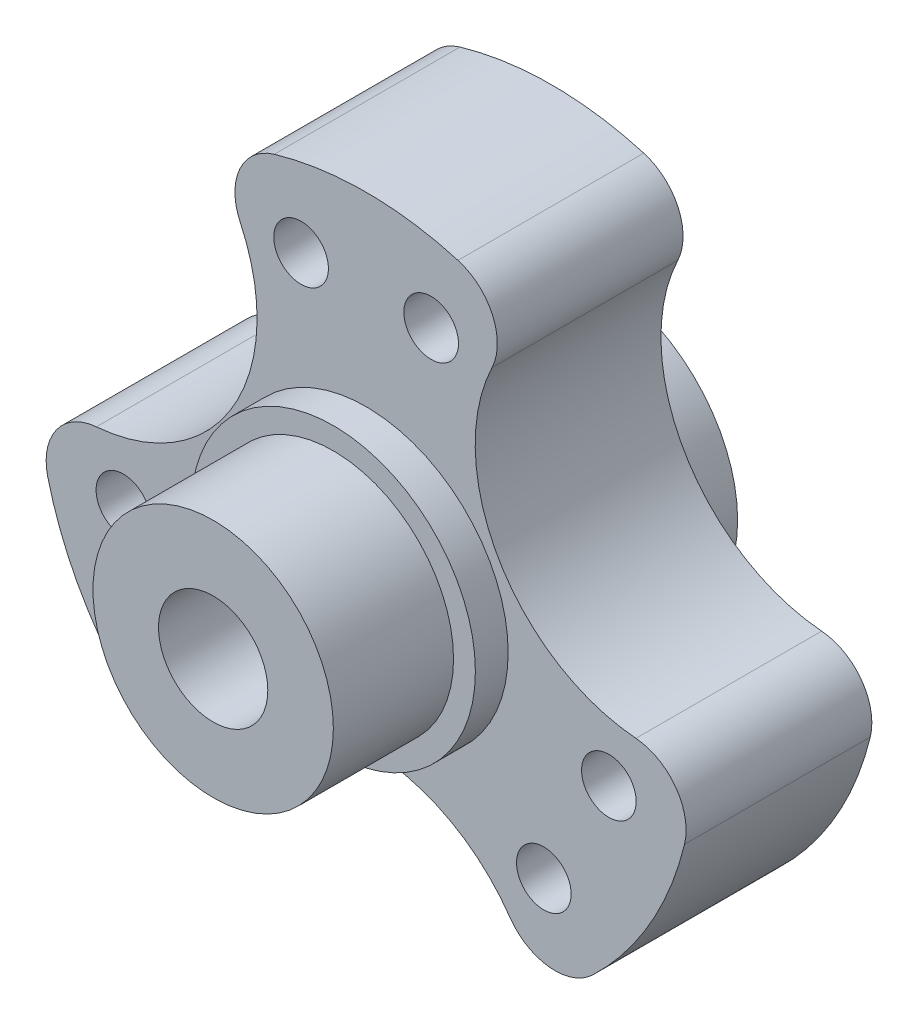
ISO-10303-21;
HEADER;
FILE_DESCRIPTION(('STEP AP214'),'2;1');
FILE_NAME('part.step','',(''),(''),'','','');
FILE_SCHEMA(('AUTOMOTIVE_DESIGN { 1 0 10303 214 1 1 1 1 }'));
ENDSEC;
DATA;
#1=APPLICATION_CONTEXT('core data for automotive mechanical design processes');
#2=APPLICATION_PROTOCOL_DEFINITION('international standard','automotive_design',2000,#1);
#3=PRODUCT_CONTEXT('',#1,'mechanical');
#4=PRODUCT('Part','Part','',(#3));
#5=PRODUCT_RELATED_PRODUCT_CATEGORY('part','',(#4));
#6=PRODUCT_DEFINITION_FORMATION('','',#4);
#7=PRODUCT_DEFINITION_CONTEXT('part definition',#1,'design');
#8=PRODUCT_DEFINITION('design','',#6,#7);
#9=PRODUCT_DEFINITION_SHAPE('','',#8);
#10=(LENGTH_UNIT() NAMED_UNIT(*) SI_UNIT(.MILLI.,.METRE.));
#11=(NAMED_UNIT(*) PLANE_ANGLE_UNIT() SI_UNIT($,.RADIAN.));
#12=(NAMED_UNIT(*) SI_UNIT($,.STERADIAN.) SOLID_ANGLE_UNIT());
#13=UNCERTAINTY_MEASURE_WITH_UNIT(LENGTH_MEASURE(1.E-05),#10,'distance_accuracy_value','');
#14=(GEOMETRIC_REPRESENTATION_CONTEXT(3) GLOBAL_UNCERTAINTY_ASSIGNED_CONTEXT((#13)) GLOBAL_UNIT_ASSIGNED_CONTEXT((#10,
#11,#12)) REPRESENTATION_CONTEXT('',''));
#15=CARTESIAN_POINT('',(0.,0.,0.));
#16=DIRECTION('',(0.,0.,1.));
#17=DIRECTION('',(1.,0.,0.));
#18=AXIS2_PLACEMENT_3D('',#15,#16,#17);
#19=CARTESIAN_POINT('',(0.,0.,17.));
#20=DIRECTION('',(0.,0.,1.));
#21=DIRECTION('',(1.,0.,0.));
#22=AXIS2_PLACEMENT_3D('',#19,#20,#21);
#23=PLANE('',#22);
#24=CARTESIAN_POINT('',(-25.9807621135332,14.9999999999999,17.));
#25=DIRECTION('',(0.,0.,1.));
#26=DIRECTION('',(-0.500000000000004,0.866025403784436,0.));
#27=AXIS2_PLACEMENT_3D('',#24,#25,#26);
#28=CIRCLE('',#27,16.);
#29=CARTESIAN_POINT('',(-24.6896299452622,-0.947820469395108,17.));
#30=VERTEX_POINT('',#29);
#31=CARTESIAN_POINT('',(-11.5239783679081,21.8557569773315,17.));
#32=VERTEX_POINT('',#31);
#33=EDGE_CURVE('E214',#30,#32,#28,.T.);
#34=ORIENTED_EDGE('',*,*,#33,.F.);
#35=CARTESIAN_POINT('',(-24.2861511426775,-5.93151436608106,17.));
#36=DIRECTION('',(0.,0.,1.));
#37=DIRECTION('',(1.,0.,0.));
#38=AXIS2_PLACEMENT_3D('',#35,#36,#37);
#39=CIRCLE('',#38,5.);
#40=CARTESIAN_POINT('',(-29.143381371213,-7.11781723929727,17.));
#41=VERTEX_POINT('',#40);
#42=EDGE_CURVE('E187',#30,#41,#39,.T.);
#43=ORIENTED_EDGE('',*,*,#42,.T.);
#44=CARTESIAN_POINT('',(0.,0.,17.));
#45=DIRECTION('',(0.,0.,1.));
#46=DIRECTION('',(1.,0.,0.));
#47=AXIS2_PLACEMENT_3D('',#44,#45,#46);
#48=CIRCLE('',#47,30.);
#49=CARTESIAN_POINT('',(-20.7359012343325,-21.6800000000001,17.));
#50=VERTEX_POINT('',#49);
#51=EDGE_CURVE('E146',#41,#50,#48,.T.);
#52=ORIENTED_EDGE('',*,*,#51,.T.);
#53=CARTESIAN_POINT('',(-17.2799176952771,-18.0666666666668,17.));
#54=DIRECTION('',(0.,0.,1.));
#55=DIRECTION('',(1.,0.,0.));
#56=AXIS2_PLACEMENT_3D('',#53,#54,#55);
#57=CIRCLE('',#56,5.);
#58=CARTESIAN_POINT('',(-13.1656515773539,-20.9079365079366,17.));
#59=VERTEX_POINT('',#58);
#60=EDGE_CURVE('E179',#50,#59,#57,.T.);
#61=ORIENTED_EDGE('',*,*,#60,.T.);
#62=CARTESIAN_POINT('',(2.09901540593194E-13,-30.,17.));
#63=DIRECTION('',(0.,0.,1.));
#64=DIRECTION('',(-0.499999999999992,-0.866025403784443,0.));
#65=AXIS2_PLACEMENT_3D('',#62,#63,#64);
#66=CIRCLE('',#65,16.);
#67=CARTESIAN_POINT('',(13.1656515773542,-20.9079365079364,17.));
#68=VERTEX_POINT('',#67);
#69=EDGE_CURVE('E211',#68,#59,#66,.T.);
#70=ORIENTED_EDGE('',*,*,#69,.F.);
#71=CARTESIAN_POINT('',(17.2799176952774,-18.0666666666665,17.));
#72=DIRECTION('',(0.,0.,1.));
#73=DIRECTION('',(1.,0.,0.));
#74=AXIS2_PLACEMENT_3D('',#71,#72,#73);
#75=CIRCLE('',#74,5.);
#76=CARTESIAN_POINT('',(20.7359012343328,-21.6799999999999,17.));
#77=VERTEX_POINT('',#76);
#78=EDGE_CURVE('E181',#68,#77,#75,.T.);
#79=ORIENTED_EDGE('',*,*,#78,.T.);
#80=CARTESIAN_POINT('',(29.143381371213,-7.11781723929728,17.));
#81=VERTEX_POINT('',#80);
#82=EDGE_CURVE('E158',#77,#81,#48,.T.);
#83=ORIENTED_EDGE('',*,*,#82,.T.);
#84=CARTESIAN_POINT('',(24.2861511426775,-5.93151436608106,17.));
#85=DIRECTION('',(0.,0.,1.));
#86=DIRECTION('',(1.,0.,0.));
#87=AXIS2_PLACEMENT_3D('',#84,#85,#86);
#88=CIRCLE('',#87,5.);
#89=CARTESIAN_POINT('',(24.6896299452622,-0.947820469395113,17.));
#90=VERTEX_POINT('',#89);
#91=EDGE_CURVE('E183',#81,#90,#88,.T.);
#92=ORIENTED_EDGE('',*,*,#91,.T.);
#93=CARTESIAN_POINT('',(25.9807621135332,14.9999999999999,17.));
#94=DIRECTION('',(0.,0.,1.));
#95=DIRECTION('',(1.,0.,0.));
#96=AXIS2_PLACEMENT_3D('',#93,#94,#95);
#97=CIRCLE('',#96,16.);
#98=CARTESIAN_POINT('',(11.5239783679081,21.8557569773315,17.));
#99=VERTEX_POINT('',#98);
#100=EDGE_CURVE('E236',#99,#90,#97,.T.);
#101=ORIENTED_EDGE('',*,*,#100,.F.);
#102=CARTESIAN_POINT('',(7.00623344740029,23.9981810327477,17.));
#103=DIRECTION('',(0.,0.,1.));
#104=DIRECTION('',(1.,0.,0.));
#105=AXIS2_PLACEMENT_3D('',#102,#103,#104);
#106=CIRCLE('',#105,5.);
#107=CARTESIAN_POINT('',(8.40748013688034,28.7978172392972,17.));
#108=VERTEX_POINT('',#107);
#109=EDGE_CURVE('E57',#99,#108,#106,.T.);
#110=ORIENTED_EDGE('',*,*,#109,.T.);
#111=CARTESIAN_POINT('',(-8.40748013688035,28.7978172392972,17.));
#112=VERTEX_POINT('',#111);
#113=EDGE_CURVE('E163',#108,#112,#48,.T.);
#114=ORIENTED_EDGE('',*,*,#113,.T.);
#115=CARTESIAN_POINT('',(-7.00623344740029,23.9981810327477,17.));
#116=DIRECTION('',(0.,0.,1.));
#117=DIRECTION('',(1.,0.,0.));
#118=AXIS2_PLACEMENT_3D('',#115,#116,#117);
#119=CIRCLE('',#118,5.);
#120=EDGE_CURVE('E49',#112,#32,#119,.T.);
#121=ORIENTED_EDGE('',*,*,#120,.T.);
#122=EDGE_LOOP('',(#34,#43,#52,#61,#70,#79,#83,#92,#101,#110,#114,#121));
#123=FACE_BOUND('',#122,.T.);
#124=CARTESIAN_POINT('',(-16.2634559672878,-16.2634559672908,17.));
#125=DIRECTION('',(0.,0.,1.));
#126=DIRECTION('',(1.,0.,0.));
#127=AXIS2_PLACEMENT_3D('',#124,#125,#126);
#128=CIRCLE('',#127,2.5);
#129=CARTESIAN_POINT('',(-13.7634559672878,-16.2634559672908,17.));
#130=VERTEX_POINT('',#129);
#131=EDGE_CURVE('E250',#130,#130,#128,.T.);
#132=ORIENTED_EDGE('',*,*,#131,.F.);
#133=EDGE_LOOP('',(#132));
#134=FACE_BOUND('',#133,.T.);
#135=CARTESIAN_POINT('',(22.2162940046501,-5.95283803735567,17.));
#136=DIRECTION('',(0.,0.,1.));
#137=DIRECTION('',(1.,0.,0.));
#138=AXIS2_PLACEMENT_3D('',#135,#136,#137);
#139=CIRCLE('',#138,2.5);
#140=CARTESIAN_POINT('',(24.7162940046501,-5.95283803735567,17.));
#141=VERTEX_POINT('',#140);
#142=EDGE_CURVE('E262',#141,#141,#139,.T.);
#143=ORIENTED_EDGE('',*,*,#142,.F.);
#144=EDGE_LOOP('',(#143));
#145=FACE_BOUND('',#144,.T.);
#146=CARTESIAN_POINT('',(-5.952838037358,22.2162940046486,17.));
#147=DIRECTION('',(0.,0.,1.));
#148=DIRECTION('',(1.,0.,0.));
#149=AXIS2_PLACEMENT_3D('',#146,#147,#148);
#150=CIRCLE('',#149,2.5);
#151=CARTESIAN_POINT('',(-3.452838037358,22.2162940046486,17.));
#152=VERTEX_POINT('',#151);
#153=EDGE_CURVE('E160',#152,#152,#150,.T.);
#154=ORIENTED_EDGE('',*,*,#153,.F.);
#155=EDGE_LOOP('',(#154));
#156=FACE_BOUND('',#155,.T.);
#157=CARTESIAN_POINT('',(5.95283803735783,22.2162940046486,17.));
#158=DIRECTION('',(0.,0.,1.));
#159=DIRECTION('',(1.,0.,0.));
#160=AXIS2_PLACEMENT_3D('',#157,#158,#159);
#161=CIRCLE('',#160,2.5);
#162=CARTESIAN_POINT('',(8.45283803735783,22.2162940046486,17.));
#163=VERTEX_POINT('',#162);
#164=EDGE_CURVE('E268',#163,#163,#161,.T.);
#165=ORIENTED_EDGE('',*,*,#164,.F.);
#166=EDGE_LOOP('',(#165));
#167=FACE_BOUND('',#166,.T.);
#168=CARTESIAN_POINT('',(16.2634559672922,-16.2634559672882,17.));
#169=DIRECTION('',(0.,0.,1.));
#170=DIRECTION('',(1.,0.,0.));
#171=AXIS2_PLACEMENT_3D('',#168,#169,#170);
#172=CIRCLE('',#171,2.5);
#173=CARTESIAN_POINT('',(18.7634559672922,-16.2634559672882,17.));
#174=VERTEX_POINT('',#173);
#175=EDGE_CURVE('E256',#174,#174,#172,.T.);
#176=ORIENTED_EDGE('',*,*,#175,.F.);
#177=EDGE_LOOP('',(#176));
#178=FACE_BOUND('',#177,.T.);
#179=CARTESIAN_POINT('',(-22.2162940046458,-5.95283803735833,17.));
#180=DIRECTION('',(0.,0.,1.));
#181=DIRECTION('',(1.,0.,0.));
#182=AXIS2_PLACEMENT_3D('',#179,#180,#181);
#183=CIRCLE('',#182,2.5);
#184=CARTESIAN_POINT('',(-19.7162940046458,-5.95283803735833,17.));
#185=VERTEX_POINT('',#184);
#186=EDGE_CURVE('E244',#185,#185,#183,.T.);
#187=ORIENTED_EDGE('',*,*,#186,.F.);
#188=EDGE_LOOP('',(#187));
#189=FACE_BOUND('',#188,.T.);
#190=CARTESIAN_POINT('',(0.,0.,17.));
#191=DIRECTION('',(0.,0.,1.));
#192=DIRECTION('',(1.,0.,0.));
#193=AXIS2_PLACEMENT_3D('',#190,#191,#192);
#194=CIRCLE('',#193,13.);
#195=CARTESIAN_POINT('',(13.,0.,17.));
#196=VERTEX_POINT('',#195);
#197=EDGE_CURVE('E552',#196,#196,#194,.T.);
#198=ORIENTED_EDGE('',*,*,#197,.F.);
#199=EDGE_LOOP('',(#198));
#200=FACE_BOUND('',#199,.T.);
#201=ADVANCED_FACE('F34',(#123,#134,#145,#156,#167,#178,#189,#200),#23,.T.);
#202=CARTESIAN_POINT('',(0.,0.,0.));
#203=DIRECTION('',(0.,0.,1.));
#204=DIRECTION('',(1.,0.,0.));
#205=AXIS2_PLACEMENT_3D('',#202,#203,#204);
#206=PLANE('',#205);
#207=CARTESIAN_POINT('',(-22.2162940046458,-5.95283803735833,0.));
#208=DIRECTION('',(0.,0.,1.));
#209=DIRECTION('',(1.,0.,0.));
#210=AXIS2_PLACEMENT_3D('',#207,#208,#209);
#211=CIRCLE('',#210,2.5);
#212=CARTESIAN_POINT('',(-19.7162940046458,-5.95283803735833,0.));
#213=VERTEX_POINT('',#212);
#214=EDGE_CURVE('E242',#213,#213,#211,.T.);
#215=ORIENTED_EDGE('',*,*,#214,.T.);
#216=EDGE_LOOP('',(#215));
#217=FACE_BOUND('',#216,.T.);
#218=CARTESIAN_POINT('',(-16.2634559672878,-16.2634559672908,0.));
#219=DIRECTION('',(0.,0.,1.));
#220=DIRECTION('',(1.,0.,0.));
#221=AXIS2_PLACEMENT_3D('',#218,#219,#220);
#222=CIRCLE('',#221,2.5);
#223=CARTESIAN_POINT('',(-13.7634559672878,-16.2634559672908,0.));
#224=VERTEX_POINT('',#223);
#225=EDGE_CURVE('E247',#224,#224,#222,.T.);
#226=ORIENTED_EDGE('',*,*,#225,.T.);
#227=EDGE_LOOP('',(#226));
#228=FACE_BOUND('',#227,.T.);
#229=CARTESIAN_POINT('',(16.2634559672922,-16.2634559672882,0.));
#230=DIRECTION('',(0.,0.,1.));
#231=DIRECTION('',(1.,0.,0.));
#232=AXIS2_PLACEMENT_3D('',#229,#230,#231);
#233=CIRCLE('',#232,2.5);
#234=CARTESIAN_POINT('',(18.7634559672922,-16.2634559672882,0.));
#235=VERTEX_POINT('',#234);
#236=EDGE_CURVE('E253',#235,#235,#233,.T.);
#237=ORIENTED_EDGE('',*,*,#236,.T.);
#238=EDGE_LOOP('',(#237));
#239=FACE_BOUND('',#238,.T.);
#240=CARTESIAN_POINT('',(22.2162940046501,-5.95283803735567,0.));
#241=DIRECTION('',(0.,0.,1.));
#242=DIRECTION('',(1.,0.,0.));
#243=AXIS2_PLACEMENT_3D('',#240,#241,#242);
#244=CIRCLE('',#243,2.5);
#245=CARTESIAN_POINT('',(24.7162940046501,-5.95283803735567,0.));
#246=VERTEX_POINT('',#245);
#247=EDGE_CURVE('E259',#246,#246,#244,.T.);
#248=ORIENTED_EDGE('',*,*,#247,.T.);
#249=EDGE_LOOP('',(#248));
#250=FACE_BOUND('',#249,.T.);
#251=CARTESIAN_POINT('',(5.95283803735783,22.2162940046486,0.));
#252=DIRECTION('',(0.,0.,1.));
#253=DIRECTION('',(1.,0.,0.));
#254=AXIS2_PLACEMENT_3D('',#251,#252,#253);
#255=CIRCLE('',#254,2.5);
#256=CARTESIAN_POINT('',(8.45283803735783,22.2162940046486,0.));
#257=VERTEX_POINT('',#256);
#258=EDGE_CURVE('E265',#257,#257,#255,.T.);
#259=ORIENTED_EDGE('',*,*,#258,.T.);
#260=EDGE_LOOP('',(#259));
#261=FACE_BOUND('',#260,.T.);
#262=CARTESIAN_POINT('',(-5.952838037358,22.2162940046486,0.));
#263=DIRECTION('',(0.,0.,1.));
#264=DIRECTION('',(1.,0.,0.));
#265=AXIS2_PLACEMENT_3D('',#262,#263,#264);
#266=CIRCLE('',#265,2.5);
#267=CARTESIAN_POINT('',(-3.452838037358,22.2162940046486,0.));
#268=VERTEX_POINT('',#267);
#269=EDGE_CURVE('E271',#268,#268,#266,.T.);
#270=ORIENTED_EDGE('',*,*,#269,.T.);
#271=EDGE_LOOP('',(#270));
#272=FACE_BOUND('',#271,.T.);
#273=CARTESIAN_POINT('',(0.,0.,0.));
#274=DIRECTION('',(0.,0.,1.));
#275=DIRECTION('',(1.,0.,0.));
#276=AXIS2_PLACEMENT_3D('',#273,#274,#275);
#277=CIRCLE('',#276,30.);
#278=CARTESIAN_POINT('',(-29.143381371213,-7.11781723929727,0.));
#279=VERTEX_POINT('',#278);
#280=CARTESIAN_POINT('',(-20.7359012343325,-21.6800000000001,0.));
#281=VERTEX_POINT('',#280);
#282=EDGE_CURVE('E143',#279,#281,#277,.T.);
#283=ORIENTED_EDGE('',*,*,#282,.F.);
#284=CARTESIAN_POINT('',(-24.2861511426775,-5.93151436608106,0.));
#285=DIRECTION('',(0.,0.,1.));
#286=DIRECTION('',(1.,0.,0.));
#287=AXIS2_PLACEMENT_3D('',#284,#285,#286);
#288=CIRCLE('',#287,5.);
#289=CARTESIAN_POINT('',(-24.6896299452622,-0.947820469395108,0.));
#290=VERTEX_POINT('',#289);
#291=EDGE_CURVE('E125',#279,#290,#288,.F.);
#292=ORIENTED_EDGE('',*,*,#291,.T.);
#293=CARTESIAN_POINT('',(-25.9807621135332,14.9999999999999,0.));
#294=DIRECTION('',(0.,0.,1.));
#295=DIRECTION('',(-0.500000000000004,0.866025403784436,0.));
#296=AXIS2_PLACEMENT_3D('',#293,#294,#295);
#297=CIRCLE('',#296,16.);
#298=CARTESIAN_POINT('',(-11.5239783679081,21.8557569773315,0.));
#299=VERTEX_POINT('',#298);
#300=EDGE_CURVE('E234',#290,#299,#297,.T.);
#301=ORIENTED_EDGE('',*,*,#300,.T.);
#302=CARTESIAN_POINT('',(-7.00623344740029,23.9981810327477,0.));
#303=DIRECTION('',(0.,0.,1.));
#304=DIRECTION('',(1.,0.,0.));
#305=AXIS2_PLACEMENT_3D('',#302,#303,#304);
#306=CIRCLE('',#305,5.);
#307=CARTESIAN_POINT('',(-8.40748013688035,28.7978172392972,0.));
#308=VERTEX_POINT('',#307);
#309=EDGE_CURVE('E136',#299,#308,#306,.F.);
#310=ORIENTED_EDGE('',*,*,#309,.T.);
#311=CARTESIAN_POINT('',(8.40748013688034,28.7978172392972,0.));
#312=VERTEX_POINT('',#311);
#313=EDGE_CURVE('E154',#312,#308,#277,.T.);
#314=ORIENTED_EDGE('',*,*,#313,.F.);
#315=CARTESIAN_POINT('',(7.00623344740029,23.9981810327477,0.));
#316=DIRECTION('',(0.,0.,1.));
#317=DIRECTION('',(1.,0.,0.));
#318=AXIS2_PLACEMENT_3D('',#315,#316,#317);
#319=CIRCLE('',#318,5.);
#320=CARTESIAN_POINT('',(11.5239783679081,21.8557569773315,0.));
#321=VERTEX_POINT('',#320);
#322=EDGE_CURVE('E174',#312,#321,#319,.F.);
#323=ORIENTED_EDGE('',*,*,#322,.T.);
#324=CARTESIAN_POINT('',(25.9807621135332,14.9999999999999,0.));
#325=DIRECTION('',(0.,0.,1.));
#326=DIRECTION('',(1.,0.,0.));
#327=AXIS2_PLACEMENT_3D('',#324,#325,#326);
#328=CIRCLE('',#327,16.);
#329=CARTESIAN_POINT('',(24.6896299452622,-0.947820469395113,0.));
#330=VERTEX_POINT('',#329);
#331=EDGE_CURVE('E239',#321,#330,#328,.T.);
#332=ORIENTED_EDGE('',*,*,#331,.T.);
#333=CARTESIAN_POINT('',(24.2861511426775,-5.93151436608106,0.));
#334=DIRECTION('',(0.,0.,1.));
#335=DIRECTION('',(1.,0.,0.));
#336=AXIS2_PLACEMENT_3D('',#333,#334,#335);
#337=CIRCLE('',#336,5.);
#338=CARTESIAN_POINT('',(29.143381371213,-7.11781723929728,0.));
#339=VERTEX_POINT('',#338);
#340=EDGE_CURVE('E172',#330,#339,#337,.F.);
#341=ORIENTED_EDGE('',*,*,#340,.T.);
#342=CARTESIAN_POINT('',(20.7359012343328,-21.6799999999999,0.));
#343=VERTEX_POINT('',#342);
#344=EDGE_CURVE('E155',#343,#339,#277,.T.);
#345=ORIENTED_EDGE('',*,*,#344,.F.);
#346=CARTESIAN_POINT('',(17.2799176952774,-18.0666666666665,0.));
#347=DIRECTION('',(0.,0.,1.));
#348=DIRECTION('',(1.,0.,0.));
#349=AXIS2_PLACEMENT_3D('',#346,#347,#348);
#350=CIRCLE('',#349,5.);
#351=CARTESIAN_POINT('',(13.1656515773542,-20.9079365079364,0.));
#352=VERTEX_POINT('',#351);
#353=EDGE_CURVE('E170',#343,#352,#350,.F.);
#354=ORIENTED_EDGE('',*,*,#353,.T.);
#355=CARTESIAN_POINT('',(2.09901540593194E-13,-30.,0.));
#356=DIRECTION('',(0.,0.,1.));
#357=DIRECTION('',(-0.499999999999992,-0.866025403784443,0.));
#358=AXIS2_PLACEMENT_3D('',#355,#356,#357);
#359=CIRCLE('',#358,16.);
#360=CARTESIAN_POINT('',(-13.1656515773539,-20.9079365079366,0.));
#361=VERTEX_POINT('',#360);
#362=EDGE_CURVE('E208',#352,#361,#359,.T.);
#363=ORIENTED_EDGE('',*,*,#362,.T.);
#364=CARTESIAN_POINT('',(-17.2799176952771,-18.0666666666668,0.));
#365=DIRECTION('',(0.,0.,1.));
#366=DIRECTION('',(1.,0.,0.));
#367=AXIS2_PLACEMENT_3D('',#364,#365,#366);
#368=CIRCLE('',#367,5.);
#369=EDGE_CURVE('E147',#361,#281,#368,.F.);
#370=ORIENTED_EDGE('',*,*,#369,.T.);
#371=EDGE_LOOP('',(#283,#292,#301,#310,#314,#323,#332,#341,#345,#354,#363,#370));
#372=FACE_BOUND('',#371,.T.);
#373=CARTESIAN_POINT('',(0.,0.,0.));
#374=DIRECTION('',(0.,0.,1.));
#375=DIRECTION('',(1.,0.,0.));
#376=AXIS2_PLACEMENT_3D('',#373,#374,#375);
#377=CIRCLE('',#376,13.);
#378=CARTESIAN_POINT('',(13.,0.,0.));
#379=VERTEX_POINT('',#378);
#380=EDGE_CURVE('E165',#379,#379,#377,.F.);
#381=ORIENTED_EDGE('',*,*,#380,.F.);
#382=EDGE_LOOP('',(#381));
#383=FACE_BOUND('',#382,.T.);
#384=ADVANCED_FACE('F150',(#217,#228,#239,#250,#261,#272,#372,#383),#206,.F.);
#385=CARTESIAN_POINT('',(0.,0.,17.));
#386=DIRECTION('',(0.,0.,-1.));
#387=DIRECTION('',(-1.,0.,0.));
#388=AXIS2_PLACEMENT_3D('',#385,#386,#387);
#389=CYLINDRICAL_SURFACE('',#388,30.);
#390=ORIENTED_EDGE('',*,*,#51,.F.);
#391=DIRECTION('',(0.,0.,-1.));
#392=VECTOR('',#391,1.);
#393=CARTESIAN_POINT('',(-29.143381371213,-7.11781723929727,17.));
#394=LINE('',#393,#392);
#395=EDGE_CURVE('E129',#41,#279,#394,.T.);
#396=ORIENTED_EDGE('',*,*,#395,.T.);
#397=ORIENTED_EDGE('',*,*,#282,.T.);
#398=DIRECTION('',(0.,0.,-1.));
#399=VECTOR('',#398,1.);
#400=CARTESIAN_POINT('',(-20.7359012343325,-21.6800000000001,17.));
#401=LINE('',#400,#399);
#402=EDGE_CURVE('E148',#281,#50,#401,.F.);
#403=ORIENTED_EDGE('',*,*,#402,.T.);
#404=EDGE_LOOP('',(#390,#396,#397,#403));
#405=FACE_BOUND('',#404,.T.);
#406=ADVANCED_FACE('F141',(#405),#389,.T.);
#407=ORIENTED_EDGE('',*,*,#313,.T.);
#408=DIRECTION('',(0.,0.,-1.));
#409=VECTOR('',#408,1.);
#410=CARTESIAN_POINT('',(-8.40748013688035,28.7978172392972,17.));
#411=LINE('',#410,#409);
#412=EDGE_CURVE('E192',#308,#112,#411,.F.);
#413=ORIENTED_EDGE('',*,*,#412,.T.);
#414=ORIENTED_EDGE('',*,*,#113,.F.);
#415=DIRECTION('',(0.,0.,-1.));
#416=VECTOR('',#415,1.);
#417=CARTESIAN_POINT('',(8.40748013688034,28.7978172392972,17.));
#418=LINE('',#417,#416);
#419=EDGE_CURVE('E189',#108,#312,#418,.T.);
#420=ORIENTED_EDGE('',*,*,#419,.T.);
#421=EDGE_LOOP('',(#407,#413,#414,#420));
#422=FACE_BOUND('',#421,.T.);
#423=ADVANCED_FACE('F291',(#422),#389,.T.);
#424=ORIENTED_EDGE('',*,*,#344,.T.);
#425=DIRECTION('',(0.,0.,-1.));
#426=VECTOR('',#425,1.);
#427=CARTESIAN_POINT('',(29.143381371213,-7.11781723929728,17.));
#428=LINE('',#427,#426);
#429=EDGE_CURVE('E201',#339,#81,#428,.F.);
#430=ORIENTED_EDGE('',*,*,#429,.T.);
#431=ORIENTED_EDGE('',*,*,#82,.F.);
#432=DIRECTION('',(0.,0.,-1.));
#433=VECTOR('',#432,1.);
#434=CARTESIAN_POINT('',(20.7359012343328,-21.6799999999999,17.));
#435=LINE('',#434,#433);
#436=EDGE_CURVE('E198',#77,#343,#435,.T.);
#437=ORIENTED_EDGE('',*,*,#436,.T.);
#438=EDGE_LOOP('',(#424,#430,#431,#437));
#439=FACE_BOUND('',#438,.T.);
#440=ADVANCED_FACE('F224',(#439),#389,.T.);
#441=CARTESIAN_POINT('',(-5.952838037358,22.2162940046486,17.));
#442=DIRECTION('',(0.,0.,-1.));
#443=DIRECTION('',(-1.,0.,0.));
#444=AXIS2_PLACEMENT_3D('',#441,#442,#443);
#445=CYLINDRICAL_SURFACE('',#444,2.5);
#446=ORIENTED_EDGE('',*,*,#153,.T.);
#447=EDGE_LOOP('',(#446));
#448=FACE_BOUND('',#447,.T.);
#449=ORIENTED_EDGE('',*,*,#269,.F.);
#450=EDGE_LOOP('',(#449));
#451=FACE_BOUND('',#450,.T.);
#452=ADVANCED_FACE('F279',(#448,#451),#445,.F.);
#453=CARTESIAN_POINT('',(5.95283803735783,22.2162940046486,17.));
#454=DIRECTION('',(0.,0.,-1.));
#455=DIRECTION('',(-1.,0.,0.));
#456=AXIS2_PLACEMENT_3D('',#453,#454,#455);
#457=CYLINDRICAL_SURFACE('',#456,2.5);
#458=ORIENTED_EDGE('',*,*,#164,.T.);
#459=EDGE_LOOP('',(#458));
#460=FACE_BOUND('',#459,.T.);
#461=ORIENTED_EDGE('',*,*,#258,.F.);
#462=EDGE_LOOP('',(#461));
#463=FACE_BOUND('',#462,.T.);
#464=ADVANCED_FACE('F281',(#460,#463),#457,.F.);
#465=CARTESIAN_POINT('',(22.2162940046501,-5.95283803735567,17.));
#466=DIRECTION('',(0.,0.,-1.));
#467=DIRECTION('',(-1.,0.,0.));
#468=AXIS2_PLACEMENT_3D('',#465,#466,#467);
#469=CYLINDRICAL_SURFACE('',#468,2.5);
#470=ORIENTED_EDGE('',*,*,#142,.T.);
#471=EDGE_LOOP('',(#470));
#472=FACE_BOUND('',#471,.T.);
#473=ORIENTED_EDGE('',*,*,#247,.F.);
#474=EDGE_LOOP('',(#473));
#475=FACE_BOUND('',#474,.T.);
#476=ADVANCED_FACE('F288',(#472,#475),#469,.F.);
#477=CARTESIAN_POINT('',(16.2634559672922,-16.2634559672882,17.));
#478=DIRECTION('',(0.,0.,-1.));
#479=DIRECTION('',(-1.,0.,0.));
#480=AXIS2_PLACEMENT_3D('',#477,#478,#479);
#481=CYLINDRICAL_SURFACE('',#480,2.5);
#482=ORIENTED_EDGE('',*,*,#175,.T.);
#483=EDGE_LOOP('',(#482));
#484=FACE_BOUND('',#483,.T.);
#485=ORIENTED_EDGE('',*,*,#236,.F.);
#486=EDGE_LOOP('',(#485));
#487=FACE_BOUND('',#486,.T.);
#488=ADVANCED_FACE('F501',(#484,#487),#481,.F.);
#489=CARTESIAN_POINT('',(-16.2634559672878,-16.2634559672908,17.));
#490=DIRECTION('',(0.,0.,-1.));
#491=DIRECTION('',(-1.,0.,0.));
#492=AXIS2_PLACEMENT_3D('',#489,#490,#491);
#493=CYLINDRICAL_SURFACE('',#492,2.5);
#494=ORIENTED_EDGE('',*,*,#131,.T.);
#495=EDGE_LOOP('',(#494));
#496=FACE_BOUND('',#495,.T.);
#497=ORIENTED_EDGE('',*,*,#225,.F.);
#498=EDGE_LOOP('',(#497));
#499=FACE_BOUND('',#498,.T.);
#500=ADVANCED_FACE('F491',(#496,#499),#493,.F.);
#501=CARTESIAN_POINT('',(-22.2162940046458,-5.95283803735833,17.));
#502=DIRECTION('',(0.,0.,-1.));
#503=DIRECTION('',(-1.,0.,0.));
#504=AXIS2_PLACEMENT_3D('',#501,#502,#503);
#505=CYLINDRICAL_SURFACE('',#504,2.5);
#506=ORIENTED_EDGE('',*,*,#186,.T.);
#507=EDGE_LOOP('',(#506));
#508=FACE_BOUND('',#507,.T.);
#509=ORIENTED_EDGE('',*,*,#214,.F.);
#510=EDGE_LOOP('',(#509));
#511=FACE_BOUND('',#510,.T.);
#512=ADVANCED_FACE('F382',(#508,#511),#505,.F.);
#513=CARTESIAN_POINT('',(25.9807621135332,14.9999999999999,0.));
#514=DIRECTION('',(0.,0.,1.));
#515=DIRECTION('',(1.,0.,0.));
#516=AXIS2_PLACEMENT_3D('',#513,#514,#515);
#517=CYLINDRICAL_SURFACE('',#516,16.);
#518=ORIENTED_EDGE('',*,*,#331,.F.);
#519=DIRECTION('',(0.,0.,1.));
#520=VECTOR('',#519,1.);
#521=CARTESIAN_POINT('',(11.5239783679081,21.8557569773315,0.));
#522=LINE('',#521,#520);
#523=EDGE_CURVE('E196',#321,#99,#522,.T.);
#524=ORIENTED_EDGE('',*,*,#523,.T.);
#525=ORIENTED_EDGE('',*,*,#100,.T.);
#526=DIRECTION('',(0.,0.,1.));
#527=VECTOR('',#526,1.);
#528=CARTESIAN_POINT('',(24.6896299452622,-0.94782046939511,0.));
#529=LINE('',#528,#527);
#530=EDGE_CURVE('E194',#90,#330,#529,.F.);
#531=ORIENTED_EDGE('',*,*,#530,.T.);
#532=EDGE_LOOP('',(#518,#524,#525,#531));
#533=FACE_BOUND('',#532,.T.);
#534=ADVANCED_FACE('F371',(#533),#517,.F.);
#535=CARTESIAN_POINT('',(-25.9807621135332,14.9999999999999,0.));
#536=DIRECTION('',(0.,0.,1.));
#537=DIRECTION('',(1.,0.,0.));
#538=AXIS2_PLACEMENT_3D('',#535,#536,#537);
#539=CYLINDRICAL_SURFACE('',#538,16.);
#540=ORIENTED_EDGE('',*,*,#300,.F.);
#541=DIRECTION('',(0.,0.,1.));
#542=VECTOR('',#541,1.);
#543=CARTESIAN_POINT('',(-24.6896299452622,-0.947820469395112,0.));
#544=LINE('',#543,#542);
#545=EDGE_CURVE('E130',#290,#30,#544,.T.);
#546=ORIENTED_EDGE('',*,*,#545,.T.);
#547=ORIENTED_EDGE('',*,*,#33,.T.);
#548=DIRECTION('',(0.,0.,1.));
#549=VECTOR('',#548,1.);
#550=CARTESIAN_POINT('',(-11.5239783679081,21.8557569773315,0.));
#551=LINE('',#550,#549);
#552=EDGE_CURVE('E135',#32,#299,#551,.F.);
#553=ORIENTED_EDGE('',*,*,#552,.T.);
#554=EDGE_LOOP('',(#540,#546,#547,#553));
#555=FACE_BOUND('',#554,.T.);
#556=ADVANCED_FACE('F360',(#555),#539,.F.);
#557=CARTESIAN_POINT('',(2.09901540593194E-13,-30.,0.));
#558=DIRECTION('',(0.,0.,1.));
#559=DIRECTION('',(1.,0.,0.));
#560=AXIS2_PLACEMENT_3D('',#557,#558,#559);
#561=CYLINDRICAL_SURFACE('',#560,16.);
#562=ORIENTED_EDGE('',*,*,#362,.F.);
#563=DIRECTION('',(0.,0.,1.));
#564=VECTOR('',#563,1.);
#565=CARTESIAN_POINT('',(13.1656515773542,-20.9079365079364,0.));
#566=LINE('',#565,#564);
#567=EDGE_CURVE('E11',#352,#68,#566,.T.);
#568=ORIENTED_EDGE('',*,*,#567,.T.);
#569=ORIENTED_EDGE('',*,*,#69,.T.);
#570=DIRECTION('',(0.,0.,1.));
#571=VECTOR('',#570,1.);
#572=CARTESIAN_POINT('',(-13.1656515773539,-20.9079365079366,0.));
#573=LINE('',#572,#571);
#574=EDGE_CURVE('E42',#59,#361,#573,.F.);
#575=ORIENTED_EDGE('',*,*,#574,.T.);
#576=EDGE_LOOP('',(#562,#568,#569,#575));
#577=FACE_BOUND('',#576,.T.);
#578=ADVANCED_FACE('F207',(#577),#561,.F.);
#579=CARTESIAN_POINT('',(0.,0.,31.));
#580=DIRECTION('',(0.,0.,-1.));
#581=DIRECTION('',(-1.,0.,0.));
#582=AXIS2_PLACEMENT_3D('',#579,#580,#581);
#583=CYLINDRICAL_SURFACE('',#582,11.);
#584=CARTESIAN_POINT('',(0.,0.,20.));
#585=DIRECTION('',(0.,0.,1.));
#586=DIRECTION('',(1.,0.,0.));
#587=AXIS2_PLACEMENT_3D('',#584,#585,#586);
#588=CIRCLE('',#587,11.);
#589=CARTESIAN_POINT('',(11.,0.,20.));
#590=VERTEX_POINT('',#589);
#591=EDGE_CURVE('E555',#590,#590,#588,.T.);
#592=ORIENTED_EDGE('',*,*,#591,.T.);
#593=EDGE_LOOP('',(#592));
#594=FACE_BOUND('',#593,.T.);
#595=CARTESIAN_POINT('',(0.,0.,31.));
#596=DIRECTION('',(0.,0.,1.));
#597=DIRECTION('',(1.,0.,0.));
#598=AXIS2_PLACEMENT_3D('',#595,#596,#597);
#599=CIRCLE('',#598,11.);
#600=CARTESIAN_POINT('',(11.,0.,31.));
#601=VERTEX_POINT('',#600);
#602=EDGE_CURVE('E228',#601,#601,#599,.T.);
#603=ORIENTED_EDGE('',*,*,#602,.F.);
#604=EDGE_LOOP('',(#603));
#605=FACE_BOUND('',#604,.T.);
#606=ADVANCED_FACE('F359',(#594,#605),#583,.T.);
#607=CARTESIAN_POINT('',(0.,0.,31.));
#608=DIRECTION('',(0.,0.,1.));
#609=DIRECTION('',(1.,0.,0.));
#610=AXIS2_PLACEMENT_3D('',#607,#608,#609);
#611=PLANE('',#610);
#612=CARTESIAN_POINT('',(0.,0.,31.));
#613=DIRECTION('',(0.,0.,1.));
#614=DIRECTION('',(1.,0.,0.));
#615=AXIS2_PLACEMENT_3D('',#612,#613,#614);
#616=CIRCLE('',#615,5.);
#617=CARTESIAN_POINT('',(5.,0.,31.));
#618=VERTEX_POINT('',#617);
#619=EDGE_CURVE('E231',#618,#618,#616,.T.);
#620=ORIENTED_EDGE('',*,*,#619,.F.);
#621=EDGE_LOOP('',(#620));
#622=FACE_BOUND('',#621,.T.);
#623=ORIENTED_EDGE('',*,*,#602,.T.);
#624=EDGE_LOOP('',(#623));
#625=FACE_BOUND('',#624,.T.);
#626=ADVANCED_FACE('F445',(#622,#625),#611,.T.);
#627=CARTESIAN_POINT('',(0.,0.,0.));
#628=DIRECTION('',(0.,0.,1.));
#629=DIRECTION('',(1.,0.,0.));
#630=AXIS2_PLACEMENT_3D('',#627,#628,#629);
#631=CYLINDRICAL_SURFACE('',#630,5.);
#632=CARTESIAN_POINT('',(0.,0.,-4.));
#633=DIRECTION('',(0.,0.,-1.));
#634=DIRECTION('',(-1.,0.,0.));
#635=AXIS2_PLACEMENT_3D('',#632,#633,#634);
#636=CIRCLE('',#635,5.);
#637=CARTESIAN_POINT('',(-5.,0.,-4.));
#638=VERTEX_POINT('',#637);
#639=EDGE_CURVE('E558',#638,#638,#636,.T.);
#640=ORIENTED_EDGE('',*,*,#639,.T.);
#641=EDGE_LOOP('',(#640));
#642=FACE_BOUND('',#641,.T.);
#643=ORIENTED_EDGE('',*,*,#619,.T.);
#644=EDGE_LOOP('',(#643));
#645=FACE_BOUND('',#644,.T.);
#646=ADVANCED_FACE('F457',(#642,#645),#631,.F.);
#647=CARTESIAN_POINT('',(0.,0.,-4.));
#648=DIRECTION('',(0.,0.,-1.));
#649=DIRECTION('',(-1.,0.,0.));
#650=AXIS2_PLACEMENT_3D('',#647,#648,#649);
#651=PLANE('',#650);
#652=CARTESIAN_POINT('',(0.,0.,-4.));
#653=DIRECTION('',(0.,0.,-1.));
#654=DIRECTION('',(-1.,0.,0.));
#655=AXIS2_PLACEMENT_3D('',#652,#653,#654);
#656=CIRCLE('',#655,13.);
#657=CARTESIAN_POINT('',(-13.,0.,-4.));
#658=VERTEX_POINT('',#657);
#659=EDGE_CURVE('E565',#658,#658,#656,.T.);
#660=ORIENTED_EDGE('',*,*,#659,.T.);
#661=EDGE_LOOP('',(#660));
#662=FACE_BOUND('',#661,.T.);
#663=ORIENTED_EDGE('',*,*,#639,.F.);
#664=EDGE_LOOP('',(#663));
#665=FACE_BOUND('',#664,.T.);
#666=ADVANCED_FACE('F453',(#662,#665),#651,.T.);
#667=CARTESIAN_POINT('',(0.,0.,-4.));
#668=DIRECTION('',(0.,0.,1.));
#669=DIRECTION('',(1.,0.,0.));
#670=AXIS2_PLACEMENT_3D('',#667,#668,#669);
#671=CYLINDRICAL_SURFACE('',#670,13.);
#672=ORIENTED_EDGE('',*,*,#659,.F.);
#673=EDGE_LOOP('',(#672));
#674=FACE_BOUND('',#673,.T.);
#675=ORIENTED_EDGE('',*,*,#380,.T.);
#676=EDGE_LOOP('',(#675));
#677=FACE_BOUND('',#676,.T.);
#678=ADVANCED_FACE('F436',(#674,#677),#671,.T.);
#679=CARTESIAN_POINT('',(0.,0.,20.));
#680=DIRECTION('',(0.,0.,1.));
#681=DIRECTION('',(1.,0.,0.));
#682=AXIS2_PLACEMENT_3D('',#679,#680,#681);
#683=PLANE('',#682);
#684=CARTESIAN_POINT('',(0.,0.,20.));
#685=DIRECTION('',(0.,0.,1.));
#686=DIRECTION('',(1.,0.,0.));
#687=AXIS2_PLACEMENT_3D('',#684,#685,#686);
#688=CIRCLE('',#687,13.);
#689=CARTESIAN_POINT('',(13.,0.,20.));
#690=VERTEX_POINT('',#689);
#691=EDGE_CURVE('E554',#690,#690,#688,.T.);
#692=ORIENTED_EDGE('',*,*,#691,.T.);
#693=EDGE_LOOP('',(#692));
#694=FACE_BOUND('',#693,.T.);
#695=ORIENTED_EDGE('',*,*,#591,.F.);
#696=EDGE_LOOP('',(#695));
#697=FACE_BOUND('',#696,.T.);
#698=ADVANCED_FACE('F427',(#694,#697),#683,.T.);
#699=CARTESIAN_POINT('',(0.,0.,20.));
#700=DIRECTION('',(0.,0.,-1.));
#701=DIRECTION('',(-1.,0.,0.));
#702=AXIS2_PLACEMENT_3D('',#699,#700,#701);
#703=CYLINDRICAL_SURFACE('',#702,13.);
#704=ORIENTED_EDGE('',*,*,#691,.F.);
#705=EDGE_LOOP('',(#704));
#706=FACE_BOUND('',#705,.T.);
#707=ORIENTED_EDGE('',*,*,#197,.T.);
#708=EDGE_LOOP('',(#707));
#709=FACE_BOUND('',#708,.T.);
#710=ADVANCED_FACE('F304',(#706,#709),#703,.T.);
#711=CARTESIAN_POINT('',(-24.2861511426775,-5.93151436608106,0.));
#712=DIRECTION('',(0.,0.,1.));
#713=DIRECTION('',(1.,0.,0.));
#714=AXIS2_PLACEMENT_3D('',#711,#712,#713);
#715=CYLINDRICAL_SURFACE('',#714,5.);
#716=ORIENTED_EDGE('',*,*,#42,.F.);
#717=ORIENTED_EDGE('',*,*,#545,.F.);
#718=ORIENTED_EDGE('',*,*,#291,.F.);
#719=ORIENTED_EDGE('',*,*,#395,.F.);
#720=EDGE_LOOP('',(#716,#717,#718,#719));
#721=FACE_BOUND('',#720,.T.);
#722=ADVANCED_FACE('F128',(#721),#715,.T.);
#723=CARTESIAN_POINT('',(-7.00623344740029,23.9981810327477,0.));
#724=DIRECTION('',(0.,0.,-1.));
#725=DIRECTION('',(-1.,0.,0.));
#726=AXIS2_PLACEMENT_3D('',#723,#724,#725);
#727=CYLINDRICAL_SURFACE('',#726,5.);
#728=ORIENTED_EDGE('',*,*,#309,.F.);
#729=ORIENTED_EDGE('',*,*,#552,.F.);
#730=ORIENTED_EDGE('',*,*,#120,.F.);
#731=ORIENTED_EDGE('',*,*,#412,.F.);
#732=EDGE_LOOP('',(#728,#729,#730,#731));
#733=FACE_BOUND('',#732,.T.);
#734=ADVANCED_FACE('F303',(#733),#727,.T.);
#735=CARTESIAN_POINT('',(7.00623344740029,23.9981810327477,0.));
#736=DIRECTION('',(0.,0.,1.));
#737=DIRECTION('',(1.,0.,0.));
#738=AXIS2_PLACEMENT_3D('',#735,#736,#737);
#739=CYLINDRICAL_SURFACE('',#738,5.);
#740=ORIENTED_EDGE('',*,*,#109,.F.);
#741=ORIENTED_EDGE('',*,*,#523,.F.);
#742=ORIENTED_EDGE('',*,*,#322,.F.);
#743=ORIENTED_EDGE('',*,*,#419,.F.);
#744=EDGE_LOOP('',(#740,#741,#742,#743));
#745=FACE_BOUND('',#744,.T.);
#746=ADVANCED_FACE('F307',(#745),#739,.T.);
#747=CARTESIAN_POINT('',(24.2861511426775,-5.93151436608106,0.));
#748=DIRECTION('',(0.,0.,-1.));
#749=DIRECTION('',(-1.,0.,0.));
#750=AXIS2_PLACEMENT_3D('',#747,#748,#749);
#751=CYLINDRICAL_SURFACE('',#750,5.);
#752=ORIENTED_EDGE('',*,*,#340,.F.);
#753=ORIENTED_EDGE('',*,*,#530,.F.);
#754=ORIENTED_EDGE('',*,*,#91,.F.);
#755=ORIENTED_EDGE('',*,*,#429,.F.);
#756=EDGE_LOOP('',(#752,#753,#754,#755));
#757=FACE_BOUND('',#756,.T.);
#758=ADVANCED_FACE('F310',(#757),#751,.T.);
#759=CARTESIAN_POINT('',(17.2799176952774,-18.0666666666665,0.));
#760=DIRECTION('',(0.,0.,1.));
#761=DIRECTION('',(1.,0.,0.));
#762=AXIS2_PLACEMENT_3D('',#759,#760,#761);
#763=CYLINDRICAL_SURFACE('',#762,5.);
#764=ORIENTED_EDGE('',*,*,#78,.F.);
#765=ORIENTED_EDGE('',*,*,#567,.F.);
#766=ORIENTED_EDGE('',*,*,#353,.F.);
#767=ORIENTED_EDGE('',*,*,#436,.F.);
#768=EDGE_LOOP('',(#764,#765,#766,#767));
#769=FACE_BOUND('',#768,.T.);
#770=ADVANCED_FACE('F227',(#769),#763,.T.);
#771=CARTESIAN_POINT('',(-17.2799176952771,-18.0666666666668,0.));
#772=DIRECTION('',(0.,0.,-1.));
#773=DIRECTION('',(-1.,0.,0.));
#774=AXIS2_PLACEMENT_3D('',#771,#772,#773);
#775=CYLINDRICAL_SURFACE('',#774,5.);
#776=ORIENTED_EDGE('',*,*,#369,.F.);
#777=ORIENTED_EDGE('',*,*,#574,.F.);
#778=ORIENTED_EDGE('',*,*,#60,.F.);
#779=ORIENTED_EDGE('',*,*,#402,.F.);
#780=EDGE_LOOP('',(#776,#777,#778,#779));
#781=FACE_BOUND('',#780,.T.);
#782=ADVANCED_FACE('F36',(#781),#775,.T.);
#783=CLOSED_SHELL('',(#201,#384,#406,#423,#440,#452,#464,#476,#488,#500,#512,#534,#556,#578,
#606,#626,#646,#666,#678,#698,#710,#722,#734,#746,#758,#770,#782));
#784=MANIFOLD_SOLID_BREP('B2',#783);
#785=ADVANCED_BREP_SHAPE_REPRESENTATION('',(#18,#784),#14);
#786=SHAPE_DEFINITION_REPRESENTATION(#9,#785);
ENDSEC;
END-ISO-10303-21;
